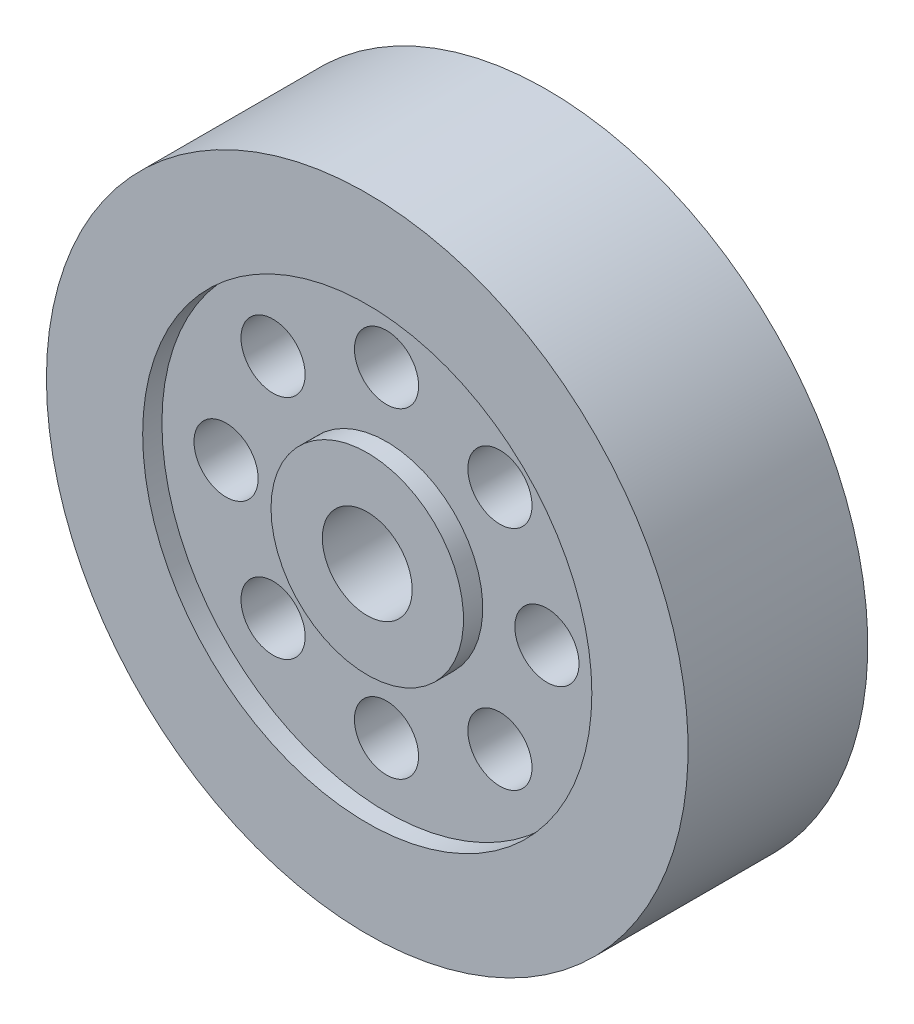
ISO-10303-21;
HEADER;
FILE_DESCRIPTION(('STEP AP214'),'2;1');
FILE_NAME('part.step','',(''),(''),'','','');
FILE_SCHEMA(('AUTOMOTIVE_DESIGN { 1 0 10303 214 1 1 1 1 }'));
ENDSEC;
DATA;
#1=APPLICATION_CONTEXT('core data for automotive mechanical design processes');
#2=APPLICATION_PROTOCOL_DEFINITION('international standard','automotive_design',2000,#1);
#3=PRODUCT_CONTEXT('',#1,'mechanical');
#4=PRODUCT('Part','Part','',(#3));
#5=PRODUCT_RELATED_PRODUCT_CATEGORY('part','',(#4));
#6=PRODUCT_DEFINITION_FORMATION('','',#4);
#7=PRODUCT_DEFINITION_CONTEXT('part definition',#1,'design');
#8=PRODUCT_DEFINITION('design','',#6,#7);
#9=PRODUCT_DEFINITION_SHAPE('','',#8);
#10=(LENGTH_UNIT() NAMED_UNIT(*) SI_UNIT(.MILLI.,.METRE.));
#11=(NAMED_UNIT(*) PLANE_ANGLE_UNIT() SI_UNIT($,.RADIAN.));
#12=(NAMED_UNIT(*) SI_UNIT($,.STERADIAN.) SOLID_ANGLE_UNIT());
#13=UNCERTAINTY_MEASURE_WITH_UNIT(LENGTH_MEASURE(1.E-05),#10,'distance_accuracy_value','');
#14=(GEOMETRIC_REPRESENTATION_CONTEXT(3) GLOBAL_UNCERTAINTY_ASSIGNED_CONTEXT((#13)) GLOBAL_UNIT_ASSIGNED_CONTEXT((#10,
#11,#12)) REPRESENTATION_CONTEXT('',''));
#15=CARTESIAN_POINT('',(0.,0.,0.));
#16=DIRECTION('',(0.,0.,1.));
#17=DIRECTION('',(1.,0.,0.));
#18=AXIS2_PLACEMENT_3D('',#15,#16,#17);
#19=CARTESIAN_POINT('',(0.,0.,-184.045185167902));
#20=DIRECTION('',(0.,0.,-1.));
#21=DIRECTION('',(-1.,0.,0.));
#22=AXIS2_PLACEMENT_3D('',#19,#20,#21);
#23=CYLINDRICAL_SURFACE('',#22,7.00000000000002);
#24=CARTESIAN_POINT('',(0.,0.,-14.));
#25=DIRECTION('',(0.,0.,-1.));
#26=DIRECTION('',(-1.,0.,0.));
#27=AXIS2_PLACEMENT_3D('',#24,#25,#26);
#28=CIRCLE('',#27,7.00000000000002);
#29=CARTESIAN_POINT('',(-7.00000000000002,0.,-14.));
#30=VERTEX_POINT('',#29);
#31=EDGE_CURVE('E10',#30,#30,#28,.T.);
#32=ORIENTED_EDGE('',*,*,#31,.T.);
#33=EDGE_LOOP('',(#32));
#34=FACE_BOUND('',#33,.T.);
#35=CARTESIAN_POINT('',(0.,0.,14.));
#36=DIRECTION('',(0.,0.,-1.));
#37=DIRECTION('',(-1.,0.,0.));
#38=AXIS2_PLACEMENT_3D('',#35,#36,#37);
#39=CIRCLE('',#38,7.00000000000002);
#40=CARTESIAN_POINT('',(-7.00000000000002,0.,14.));
#41=VERTEX_POINT('',#40);
#42=EDGE_CURVE('E73',#41,#41,#39,.T.);
#43=ORIENTED_EDGE('',*,*,#42,.F.);
#44=EDGE_LOOP('',(#43));
#45=FACE_BOUND('',#44,.T.);
#46=ADVANCED_FACE('F37',(#34,#45),#23,.F.);
#47=CARTESIAN_POINT('',(7.00000000000002,0.,-14.));
#48=DIRECTION('',(0.,0.,1.));
#49=DIRECTION('',(1.,0.,0.));
#50=AXIS2_PLACEMENT_3D('',#47,#48,#49);
#51=PLANE('',#50);
#52=ORIENTED_EDGE('',*,*,#31,.F.);
#53=EDGE_LOOP('',(#52));
#54=FACE_BOUND('',#53,.T.);
#55=CARTESIAN_POINT('',(0.,0.,-14.));
#56=DIRECTION('',(0.,0.,-1.));
#57=DIRECTION('',(-1.,0.,0.));
#58=AXIS2_PLACEMENT_3D('',#55,#56,#57);
#59=CIRCLE('',#58,15.);
#60=CARTESIAN_POINT('',(-15.,0.,-14.));
#61=VERTEX_POINT('',#60);
#62=EDGE_CURVE('E43',#61,#61,#59,.T.);
#63=ORIENTED_EDGE('',*,*,#62,.T.);
#64=EDGE_LOOP('',(#63));
#65=FACE_BOUND('',#64,.T.);
#66=ADVANCED_FACE('F149',(#54,#65),#51,.F.);
#67=CARTESIAN_POINT('',(0.,0.,-184.045185167902));
#68=DIRECTION('',(0.,0.,-1.));
#69=DIRECTION('',(-1.,0.,0.));
#70=AXIS2_PLACEMENT_3D('',#67,#68,#69);
#71=CYLINDRICAL_SURFACE('',#70,15.);
#72=ORIENTED_EDGE('',*,*,#62,.F.);
#73=EDGE_LOOP('',(#72));
#74=FACE_BOUND('',#73,.T.);
#75=CARTESIAN_POINT('',(0.,0.,-11.));
#76=DIRECTION('',(0.,0.,-1.));
#77=DIRECTION('',(-1.,0.,0.));
#78=AXIS2_PLACEMENT_3D('',#75,#76,#77);
#79=CIRCLE('',#78,15.);
#80=CARTESIAN_POINT('',(-15.,0.,-11.));
#81=VERTEX_POINT('',#80);
#82=EDGE_CURVE('E47',#81,#81,#79,.T.);
#83=ORIENTED_EDGE('',*,*,#82,.T.);
#84=EDGE_LOOP('',(#83));
#85=FACE_BOUND('',#84,.T.);
#86=ADVANCED_FACE('F153',(#74,#85),#71,.T.);
#87=CARTESIAN_POINT('',(15.,0.,-11.));
#88=DIRECTION('',(0.,0.,1.));
#89=DIRECTION('',(1.,0.,0.));
#90=AXIS2_PLACEMENT_3D('',#87,#88,#89);
#91=PLANE('',#90);
#92=CARTESIAN_POINT('',(-25.,0.,-11.));
#93=DIRECTION('',(0.,0.,-1.));
#94=DIRECTION('',(0.,1.,0.));
#95=AXIS2_PLACEMENT_3D('',#92,#93,#94);
#96=CIRCLE('',#95,5.);
#97=CARTESIAN_POINT('',(-25.,5.00000000000009,-11.));
#98=VERTEX_POINT('',#97);
#99=EDGE_CURVE('E68',#98,#98,#96,.T.);
#100=ORIENTED_EDGE('',*,*,#99,.F.);
#101=EDGE_LOOP('',(#100));
#102=FACE_BOUND('',#101,.T.);
#103=CARTESIAN_POINT('',(-17.6776695296636,17.6776695296638,-11.));
#104=DIRECTION('',(0.,0.,-1.));
#105=DIRECTION('',(0.707106781186551,0.707106781186544,0.));
#106=AXIS2_PLACEMENT_3D('',#103,#104,#105);
#107=CIRCLE('',#106,5.);
#108=CARTESIAN_POINT('',(-14.1421356237308,21.2132034355965,-11.));
#109=VERTEX_POINT('',#108);
#110=EDGE_CURVE('E82',#109,#109,#107,.T.);
#111=ORIENTED_EDGE('',*,*,#110,.F.);
#112=EDGE_LOOP('',(#111));
#113=FACE_BOUND('',#112,.T.);
#114=CARTESIAN_POINT('',(0.,25.,-11.));
#115=DIRECTION('',(0.,0.,-1.));
#116=DIRECTION('',(1.,0.,0.));
#117=AXIS2_PLACEMENT_3D('',#114,#115,#116);
#118=CIRCLE('',#117,5.);
#119=CARTESIAN_POINT('',(5.,25.,-11.));
#120=VERTEX_POINT('',#119);
#121=EDGE_CURVE('E79',#120,#120,#118,.T.);
#122=ORIENTED_EDGE('',*,*,#121,.F.);
#123=EDGE_LOOP('',(#122));
#124=FACE_BOUND('',#123,.T.);
#125=CARTESIAN_POINT('',(17.6776695296638,17.6776695296635,-11.));
#126=DIRECTION('',(0.,0.,-1.));
#127=DIRECTION('',(0.707106781186541,-0.707106781186554,0.));
#128=AXIS2_PLACEMENT_3D('',#125,#126,#127);
#129=CIRCLE('',#128,5.);
#130=CARTESIAN_POINT('',(21.2132034355966,14.1421356237308,-11.));
#131=VERTEX_POINT('',#130);
#132=EDGE_CURVE('E76',#131,#131,#129,.T.);
#133=ORIENTED_EDGE('',*,*,#132,.F.);
#134=EDGE_LOOP('',(#133));
#135=FACE_BOUND('',#134,.T.);
#136=CARTESIAN_POINT('',(25.,-2.61861100413235E-13,-11.));
#137=DIRECTION('',(0.,0.,-1.));
#138=DIRECTION('',(0.,-1.,0.));
#139=AXIS2_PLACEMENT_3D('',#136,#137,#138);
#140=CIRCLE('',#139,5.);
#141=CARTESIAN_POINT('',(25.,-5.00000000000026,-11.));
#142=VERTEX_POINT('',#141);
#143=EDGE_CURVE('E72',#142,#142,#140,.T.);
#144=ORIENTED_EDGE('',*,*,#143,.F.);
#145=EDGE_LOOP('',(#144));
#146=FACE_BOUND('',#145,.T.);
#147=CARTESIAN_POINT('',(17.6776695296635,-17.6776695296639,-11.));
#148=DIRECTION('',(0.,0.,-1.));
#149=DIRECTION('',(-0.707106781186556,-0.707106781186539,0.));
#150=AXIS2_PLACEMENT_3D('',#147,#148,#149);
#151=CIRCLE('',#150,5.);
#152=CARTESIAN_POINT('',(14.1421356237307,-21.2132034355966,-11.));
#153=VERTEX_POINT('',#152);
#154=EDGE_CURVE('E69',#153,#153,#151,.T.);
#155=ORIENTED_EDGE('',*,*,#154,.F.);
#156=EDGE_LOOP('',(#155));
#157=FACE_BOUND('',#156,.T.);
#158=CARTESIAN_POINT('',(-17.6776695296637,-17.6776695296637,-11.));
#159=DIRECTION('',(0.,0.,-1.));
#160=DIRECTION('',(-0.707106781186546,0.707106781186549,0.));
#161=AXIS2_PLACEMENT_3D('',#158,#159,#160);
#162=CIRCLE('',#161,5.);
#163=CARTESIAN_POINT('',(-21.2132034355965,-14.1421356237309,-11.));
#164=VERTEX_POINT('',#163);
#165=EDGE_CURVE('E65',#164,#164,#162,.T.);
#166=ORIENTED_EDGE('',*,*,#165,.F.);
#167=EDGE_LOOP('',(#166));
#168=FACE_BOUND('',#167,.T.);
#169=CARTESIAN_POINT('',(0.,-25.,-11.));
#170=DIRECTION('',(0.,0.,-1.));
#171=DIRECTION('',(-1.,0.,0.));
#172=AXIS2_PLACEMENT_3D('',#169,#170,#171);
#173=CIRCLE('',#172,5.);
#174=CARTESIAN_POINT('',(-5.,-25.,-11.));
#175=VERTEX_POINT('',#174);
#176=EDGE_CURVE('E62',#175,#175,#173,.T.);
#177=ORIENTED_EDGE('',*,*,#176,.F.);
#178=EDGE_LOOP('',(#177));
#179=FACE_BOUND('',#178,.T.);
#180=ORIENTED_EDGE('',*,*,#82,.F.);
#181=EDGE_LOOP('',(#180));
#182=FACE_BOUND('',#181,.T.);
#183=CARTESIAN_POINT('',(0.,0.,-11.));
#184=DIRECTION('',(0.,0.,-1.));
#185=DIRECTION('',(-1.,0.,0.));
#186=AXIS2_PLACEMENT_3D('',#183,#184,#185);
#187=CIRCLE('',#186,35.);
#188=CARTESIAN_POINT('',(-35.,0.,-11.));
#189=VERTEX_POINT('',#188);
#190=EDGE_CURVE('E51',#189,#189,#187,.T.);
#191=ORIENTED_EDGE('',*,*,#190,.T.);
#192=EDGE_LOOP('',(#191));
#193=FACE_BOUND('',#192,.T.);
#194=ADVANCED_FACE('F203',(#102,#113,#124,#135,#146,#157,#168,#179,#182,#193),#91,.F.);
#195=CARTESIAN_POINT('',(0.,0.,-184.045185167902));
#196=DIRECTION('',(0.,0.,-1.));
#197=DIRECTION('',(-1.,0.,0.));
#198=AXIS2_PLACEMENT_3D('',#195,#196,#197);
#199=CYLINDRICAL_SURFACE('',#198,35.);
#200=ORIENTED_EDGE('',*,*,#190,.F.);
#201=EDGE_LOOP('',(#200));
#202=FACE_BOUND('',#201,.T.);
#203=CARTESIAN_POINT('',(0.,0.,-14.));
#204=DIRECTION('',(0.,0.,-1.));
#205=DIRECTION('',(-1.,0.,0.));
#206=AXIS2_PLACEMENT_3D('',#203,#204,#205);
#207=CIRCLE('',#206,35.);
#208=CARTESIAN_POINT('',(-35.,0.,-14.));
#209=VERTEX_POINT('',#208);
#210=EDGE_CURVE('E56',#209,#209,#207,.T.);
#211=ORIENTED_EDGE('',*,*,#210,.T.);
#212=EDGE_LOOP('',(#211));
#213=FACE_BOUND('',#212,.T.);
#214=ADVANCED_FACE('F195',(#202,#213),#199,.F.);
#215=CARTESIAN_POINT('',(35.,0.,-14.));
#216=DIRECTION('',(0.,0.,1.));
#217=DIRECTION('',(1.,0.,0.));
#218=AXIS2_PLACEMENT_3D('',#215,#216,#217);
#219=PLANE('',#218);
#220=ORIENTED_EDGE('',*,*,#210,.F.);
#221=EDGE_LOOP('',(#220));
#222=FACE_BOUND('',#221,.T.);
#223=CARTESIAN_POINT('',(0.,0.,-14.));
#224=DIRECTION('',(0.,0.,-1.));
#225=DIRECTION('',(-1.,0.,0.));
#226=AXIS2_PLACEMENT_3D('',#223,#224,#225);
#227=CIRCLE('',#226,50.);
#228=CARTESIAN_POINT('',(-50.,0.,-14.));
#229=VERTEX_POINT('',#228);
#230=EDGE_CURVE('E59',#229,#229,#227,.T.);
#231=ORIENTED_EDGE('',*,*,#230,.T.);
#232=EDGE_LOOP('',(#231));
#233=FACE_BOUND('',#232,.T.);
#234=ADVANCED_FACE('F185',(#222,#233),#219,.F.);
#235=CARTESIAN_POINT('',(0.,0.,-184.045185167902));
#236=DIRECTION('',(0.,0.,-1.));
#237=DIRECTION('',(-1.,0.,0.));
#238=AXIS2_PLACEMENT_3D('',#235,#236,#237);
#239=CYLINDRICAL_SURFACE('',#238,50.);
#240=ORIENTED_EDGE('',*,*,#230,.F.);
#241=EDGE_LOOP('',(#240));
#242=FACE_BOUND('',#241,.T.);
#243=CARTESIAN_POINT('',(0.,0.,14.));
#244=DIRECTION('',(0.,0.,-1.));
#245=DIRECTION('',(-1.,0.,0.));
#246=AXIS2_PLACEMENT_3D('',#243,#244,#245);
#247=CIRCLE('',#246,50.);
#248=CARTESIAN_POINT('',(-50.,0.,14.));
#249=VERTEX_POINT('',#248);
#250=EDGE_CURVE('E101',#249,#249,#247,.T.);
#251=ORIENTED_EDGE('',*,*,#250,.T.);
#252=EDGE_LOOP('',(#251));
#253=FACE_BOUND('',#252,.T.);
#254=ADVANCED_FACE('F182',(#242,#253),#239,.T.);
#255=CARTESIAN_POINT('',(0.,-25.,0.));
#256=DIRECTION('',(0.,0.,-1.));
#257=DIRECTION('',(-1.,0.,0.));
#258=AXIS2_PLACEMENT_3D('',#255,#256,#257);
#259=CYLINDRICAL_SURFACE('',#258,5.);
#260=ORIENTED_EDGE('',*,*,#176,.T.);
#261=EDGE_LOOP('',(#260));
#262=FACE_BOUND('',#261,.T.);
#263=CARTESIAN_POINT('',(0.,-25.,11.));
#264=DIRECTION('',(0.,0.,-1.));
#265=DIRECTION('',(-1.,0.,0.));
#266=AXIS2_PLACEMENT_3D('',#263,#264,#265);
#267=CIRCLE('',#266,5.);
#268=CARTESIAN_POINT('',(-5.,-25.,11.));
#269=VERTEX_POINT('',#268);
#270=EDGE_CURVE('E104',#269,#269,#267,.T.);
#271=ORIENTED_EDGE('',*,*,#270,.F.);
#272=EDGE_LOOP('',(#271));
#273=FACE_BOUND('',#272,.T.);
#274=ADVANCED_FACE('F184',(#262,#273),#259,.F.);
#275=CARTESIAN_POINT('',(-17.6776695296637,-17.6776695296637,0.));
#276=DIRECTION('',(0.,0.,-1.));
#277=DIRECTION('',(-1.,0.,0.));
#278=AXIS2_PLACEMENT_3D('',#275,#276,#277);
#279=CYLINDRICAL_SURFACE('',#278,5.);
#280=ORIENTED_EDGE('',*,*,#165,.T.);
#281=EDGE_LOOP('',(#280));
#282=FACE_BOUND('',#281,.T.);
#283=CARTESIAN_POINT('',(-17.6776695296637,-17.6776695296637,11.));
#284=DIRECTION('',(0.,0.,-1.));
#285=DIRECTION('',(-0.707106781186546,0.707106781186549,0.));
#286=AXIS2_PLACEMENT_3D('',#283,#284,#285);
#287=CIRCLE('',#286,5.);
#288=CARTESIAN_POINT('',(-21.2132034355965,-14.1421356237309,11.));
#289=VERTEX_POINT('',#288);
#290=EDGE_CURVE('E107',#289,#289,#287,.T.);
#291=ORIENTED_EDGE('',*,*,#290,.F.);
#292=EDGE_LOOP('',(#291));
#293=FACE_BOUND('',#292,.T.);
#294=ADVANCED_FACE('F192',(#282,#293),#279,.F.);
#295=CARTESIAN_POINT('',(17.6776695296635,-17.6776695296639,0.));
#296=DIRECTION('',(0.,0.,-1.));
#297=DIRECTION('',(-1.,0.,0.));
#298=AXIS2_PLACEMENT_3D('',#295,#296,#297);
#299=CYLINDRICAL_SURFACE('',#298,5.);
#300=ORIENTED_EDGE('',*,*,#154,.T.);
#301=EDGE_LOOP('',(#300));
#302=FACE_BOUND('',#301,.T.);
#303=CARTESIAN_POINT('',(17.6776695296635,-17.6776695296639,11.));
#304=DIRECTION('',(0.,0.,-1.));
#305=DIRECTION('',(-0.707106781186556,-0.707106781186539,0.));
#306=AXIS2_PLACEMENT_3D('',#303,#304,#305);
#307=CIRCLE('',#306,5.);
#308=CARTESIAN_POINT('',(14.1421356237307,-21.2132034355966,11.));
#309=VERTEX_POINT('',#308);
#310=EDGE_CURVE('E111',#309,#309,#307,.T.);
#311=ORIENTED_EDGE('',*,*,#310,.F.);
#312=EDGE_LOOP('',(#311));
#313=FACE_BOUND('',#312,.T.);
#314=ADVANCED_FACE('F274',(#302,#313),#299,.F.);
#315=CARTESIAN_POINT('',(25.,-2.61861100413235E-13,0.));
#316=DIRECTION('',(0.,0.,-1.));
#317=DIRECTION('',(-1.,0.,0.));
#318=AXIS2_PLACEMENT_3D('',#315,#316,#317);
#319=CYLINDRICAL_SURFACE('',#318,5.);
#320=ORIENTED_EDGE('',*,*,#143,.T.);
#321=EDGE_LOOP('',(#320));
#322=FACE_BOUND('',#321,.T.);
#323=CARTESIAN_POINT('',(25.,-2.61861100413235E-13,11.));
#324=DIRECTION('',(0.,0.,-1.));
#325=DIRECTION('',(0.,-1.,0.));
#326=AXIS2_PLACEMENT_3D('',#323,#324,#325);
#327=CIRCLE('',#326,5.);
#328=CARTESIAN_POINT('',(25.,-5.00000000000026,11.));
#329=VERTEX_POINT('',#328);
#330=EDGE_CURVE('E114',#329,#329,#327,.T.);
#331=ORIENTED_EDGE('',*,*,#330,.F.);
#332=EDGE_LOOP('',(#331));
#333=FACE_BOUND('',#332,.T.);
#334=ADVANCED_FACE('F284',(#322,#333),#319,.F.);
#335=CARTESIAN_POINT('',(17.6776695296638,17.6776695296635,0.));
#336=DIRECTION('',(0.,0.,-1.));
#337=DIRECTION('',(-1.,0.,0.));
#338=AXIS2_PLACEMENT_3D('',#335,#336,#337);
#339=CYLINDRICAL_SURFACE('',#338,5.);
#340=ORIENTED_EDGE('',*,*,#132,.T.);
#341=EDGE_LOOP('',(#340));
#342=FACE_BOUND('',#341,.T.);
#343=CARTESIAN_POINT('',(17.6776695296638,17.6776695296635,11.));
#344=DIRECTION('',(0.,0.,-1.));
#345=DIRECTION('',(0.707106781186541,-0.707106781186554,0.));
#346=AXIS2_PLACEMENT_3D('',#343,#344,#345);
#347=CIRCLE('',#346,5.);
#348=CARTESIAN_POINT('',(21.2132034355966,14.1421356237308,11.));
#349=VERTEX_POINT('',#348);
#350=EDGE_CURVE('E117',#349,#349,#347,.T.);
#351=ORIENTED_EDGE('',*,*,#350,.F.);
#352=EDGE_LOOP('',(#351));
#353=FACE_BOUND('',#352,.T.);
#354=ADVANCED_FACE('F295',(#342,#353),#339,.F.);
#355=CARTESIAN_POINT('',(0.,25.,0.));
#356=DIRECTION('',(0.,0.,-1.));
#357=DIRECTION('',(-1.,0.,0.));
#358=AXIS2_PLACEMENT_3D('',#355,#356,#357);
#359=CYLINDRICAL_SURFACE('',#358,5.);
#360=ORIENTED_EDGE('',*,*,#121,.T.);
#361=EDGE_LOOP('',(#360));
#362=FACE_BOUND('',#361,.T.);
#363=CARTESIAN_POINT('',(0.,25.,11.));
#364=DIRECTION('',(0.,0.,-1.));
#365=DIRECTION('',(1.,0.,0.));
#366=AXIS2_PLACEMENT_3D('',#363,#364,#365);
#367=CIRCLE('',#366,5.);
#368=CARTESIAN_POINT('',(5.,25.,11.));
#369=VERTEX_POINT('',#368);
#370=EDGE_CURVE('E120',#369,#369,#367,.T.);
#371=ORIENTED_EDGE('',*,*,#370,.F.);
#372=EDGE_LOOP('',(#371));
#373=FACE_BOUND('',#372,.T.);
#374=ADVANCED_FACE('F145',(#362,#373),#359,.F.);
#375=CARTESIAN_POINT('',(-17.6776695296636,17.6776695296638,0.));
#376=DIRECTION('',(0.,0.,-1.));
#377=DIRECTION('',(-1.,0.,0.));
#378=AXIS2_PLACEMENT_3D('',#375,#376,#377);
#379=CYLINDRICAL_SURFACE('',#378,5.);
#380=ORIENTED_EDGE('',*,*,#110,.T.);
#381=EDGE_LOOP('',(#380));
#382=FACE_BOUND('',#381,.T.);
#383=CARTESIAN_POINT('',(-17.6776695296636,17.6776695296638,11.));
#384=DIRECTION('',(0.,0.,-1.));
#385=DIRECTION('',(0.707106781186551,0.707106781186544,0.));
#386=AXIS2_PLACEMENT_3D('',#383,#384,#385);
#387=CIRCLE('',#386,5.);
#388=CARTESIAN_POINT('',(-14.1421356237308,21.2132034355965,11.));
#389=VERTEX_POINT('',#388);
#390=EDGE_CURVE('E123',#389,#389,#387,.T.);
#391=ORIENTED_EDGE('',*,*,#390,.F.);
#392=EDGE_LOOP('',(#391));
#393=FACE_BOUND('',#392,.T.);
#394=ADVANCED_FACE('F135',(#382,#393),#379,.F.);
#395=CARTESIAN_POINT('',(-25.,0.,0.));
#396=DIRECTION('',(0.,0.,-1.));
#397=DIRECTION('',(-1.,0.,0.));
#398=AXIS2_PLACEMENT_3D('',#395,#396,#397);
#399=CYLINDRICAL_SURFACE('',#398,5.);
#400=ORIENTED_EDGE('',*,*,#99,.T.);
#401=EDGE_LOOP('',(#400));
#402=FACE_BOUND('',#401,.T.);
#403=CARTESIAN_POINT('',(-25.,0.,11.));
#404=DIRECTION('',(0.,0.,-1.));
#405=DIRECTION('',(0.,1.,0.));
#406=AXIS2_PLACEMENT_3D('',#403,#404,#405);
#407=CIRCLE('',#406,5.);
#408=CARTESIAN_POINT('',(-25.,5.00000000000009,11.));
#409=VERTEX_POINT('',#408);
#410=EDGE_CURVE('E110',#409,#409,#407,.T.);
#411=ORIENTED_EDGE('',*,*,#410,.F.);
#412=EDGE_LOOP('',(#411));
#413=FACE_BOUND('',#412,.T.);
#414=ADVANCED_FACE('F132',(#402,#413),#399,.F.);
#415=CARTESIAN_POINT('',(7.00000000000002,0.,14.));
#416=DIRECTION('',(0.,0.,-1.));
#417=DIRECTION('',(1.,0.,0.));
#418=AXIS2_PLACEMENT_3D('',#415,#416,#417);
#419=PLANE('',#418);
#420=ORIENTED_EDGE('',*,*,#42,.T.);
#421=EDGE_LOOP('',(#420));
#422=FACE_BOUND('',#421,.T.);
#423=CARTESIAN_POINT('',(0.,0.,14.));
#424=DIRECTION('',(0.,0.,-1.));
#425=DIRECTION('',(-1.,0.,0.));
#426=AXIS2_PLACEMENT_3D('',#423,#424,#425);
#427=CIRCLE('',#426,15.);
#428=CARTESIAN_POINT('',(-15.,0.,14.));
#429=VERTEX_POINT('',#428);
#430=EDGE_CURVE('E89',#429,#429,#427,.T.);
#431=ORIENTED_EDGE('',*,*,#430,.F.);
#432=EDGE_LOOP('',(#431));
#433=FACE_BOUND('',#432,.T.);
#434=ADVANCED_FACE('F134',(#422,#433),#419,.F.);
#435=CARTESIAN_POINT('',(0.,0.,184.045185167902));
#436=DIRECTION('',(0.,0.,1.));
#437=DIRECTION('',(-1.,0.,0.));
#438=AXIS2_PLACEMENT_3D('',#435,#436,#437);
#439=CYLINDRICAL_SURFACE('',#438,15.);
#440=ORIENTED_EDGE('',*,*,#430,.T.);
#441=EDGE_LOOP('',(#440));
#442=FACE_BOUND('',#441,.T.);
#443=CARTESIAN_POINT('',(0.,0.,11.));
#444=DIRECTION('',(0.,0.,-1.));
#445=DIRECTION('',(-1.,0.,0.));
#446=AXIS2_PLACEMENT_3D('',#443,#444,#445);
#447=CIRCLE('',#446,15.);
#448=CARTESIAN_POINT('',(-15.,0.,11.));
#449=VERTEX_POINT('',#448);
#450=EDGE_CURVE('E92',#449,#449,#447,.T.);
#451=ORIENTED_EDGE('',*,*,#450,.F.);
#452=EDGE_LOOP('',(#451));
#453=FACE_BOUND('',#452,.T.);
#454=ADVANCED_FACE('F142',(#442,#453),#439,.T.);
#455=CARTESIAN_POINT('',(15.,0.,11.));
#456=DIRECTION('',(0.,0.,-1.));
#457=DIRECTION('',(1.,0.,0.));
#458=AXIS2_PLACEMENT_3D('',#455,#456,#457);
#459=PLANE('',#458);
#460=ORIENTED_EDGE('',*,*,#410,.T.);
#461=EDGE_LOOP('',(#460));
#462=FACE_BOUND('',#461,.T.);
#463=ORIENTED_EDGE('',*,*,#390,.T.);
#464=EDGE_LOOP('',(#463));
#465=FACE_BOUND('',#464,.T.);
#466=ORIENTED_EDGE('',*,*,#370,.T.);
#467=EDGE_LOOP('',(#466));
#468=FACE_BOUND('',#467,.T.);
#469=ORIENTED_EDGE('',*,*,#350,.T.);
#470=EDGE_LOOP('',(#469));
#471=FACE_BOUND('',#470,.T.);
#472=ORIENTED_EDGE('',*,*,#330,.T.);
#473=EDGE_LOOP('',(#472));
#474=FACE_BOUND('',#473,.T.);
#475=ORIENTED_EDGE('',*,*,#310,.T.);
#476=EDGE_LOOP('',(#475));
#477=FACE_BOUND('',#476,.T.);
#478=ORIENTED_EDGE('',*,*,#290,.T.);
#479=EDGE_LOOP('',(#478));
#480=FACE_BOUND('',#479,.T.);
#481=ORIENTED_EDGE('',*,*,#270,.T.);
#482=EDGE_LOOP('',(#481));
#483=FACE_BOUND('',#482,.T.);
#484=ORIENTED_EDGE('',*,*,#450,.T.);
#485=EDGE_LOOP('',(#484));
#486=FACE_BOUND('',#485,.T.);
#487=CARTESIAN_POINT('',(0.,0.,11.));
#488=DIRECTION('',(0.,0.,-1.));
#489=DIRECTION('',(-1.,0.,0.));
#490=AXIS2_PLACEMENT_3D('',#487,#488,#489);
#491=CIRCLE('',#490,35.);
#492=CARTESIAN_POINT('',(-35.,0.,11.));
#493=VERTEX_POINT('',#492);
#494=EDGE_CURVE('E95',#493,#493,#491,.T.);
#495=ORIENTED_EDGE('',*,*,#494,.F.);
#496=EDGE_LOOP('',(#495));
#497=FACE_BOUND('',#496,.T.);
#498=ADVANCED_FACE('F129',(#462,#465,#468,#471,#474,#477,#480,#483,#486,#497),#459,.F.);
#499=CARTESIAN_POINT('',(0.,0.,184.045185167902));
#500=DIRECTION('',(0.,0.,1.));
#501=DIRECTION('',(-1.,0.,0.));
#502=AXIS2_PLACEMENT_3D('',#499,#500,#501);
#503=CYLINDRICAL_SURFACE('',#502,35.);
#504=ORIENTED_EDGE('',*,*,#494,.T.);
#505=EDGE_LOOP('',(#504));
#506=FACE_BOUND('',#505,.T.);
#507=CARTESIAN_POINT('',(0.,0.,14.));
#508=DIRECTION('',(0.,0.,-1.));
#509=DIRECTION('',(-1.,0.,0.));
#510=AXIS2_PLACEMENT_3D('',#507,#508,#509);
#511=CIRCLE('',#510,35.);
#512=CARTESIAN_POINT('',(-35.,0.,14.));
#513=VERTEX_POINT('',#512);
#514=EDGE_CURVE('E98',#513,#513,#511,.T.);
#515=ORIENTED_EDGE('',*,*,#514,.F.);
#516=EDGE_LOOP('',(#515));
#517=FACE_BOUND('',#516,.T.);
#518=ADVANCED_FACE('F167',(#506,#517),#503,.F.);
#519=CARTESIAN_POINT('',(35.,0.,14.));
#520=DIRECTION('',(0.,0.,-1.));
#521=DIRECTION('',(1.,0.,0.));
#522=AXIS2_PLACEMENT_3D('',#519,#520,#521);
#523=PLANE('',#522);
#524=ORIENTED_EDGE('',*,*,#514,.T.);
#525=EDGE_LOOP('',(#524));
#526=FACE_BOUND('',#525,.T.);
#527=ORIENTED_EDGE('',*,*,#250,.F.);
#528=EDGE_LOOP('',(#527));
#529=FACE_BOUND('',#528,.T.);
#530=ADVANCED_FACE('F173',(#526,#529),#523,.F.);
#531=CLOSED_SHELL('',(#46,#66,#86,#194,#214,#234,#254,#274,#294,#314,#334,#354,#374,#394,#414,
#434,#454,#498,#518,#530));
#532=MANIFOLD_SOLID_BREP('B2',#531);
#533=ADVANCED_BREP_SHAPE_REPRESENTATION('',(#18,#532),#14);
#534=SHAPE_DEFINITION_REPRESENTATION(#9,#533);
ENDSEC;
END-ISO-10303-21;
